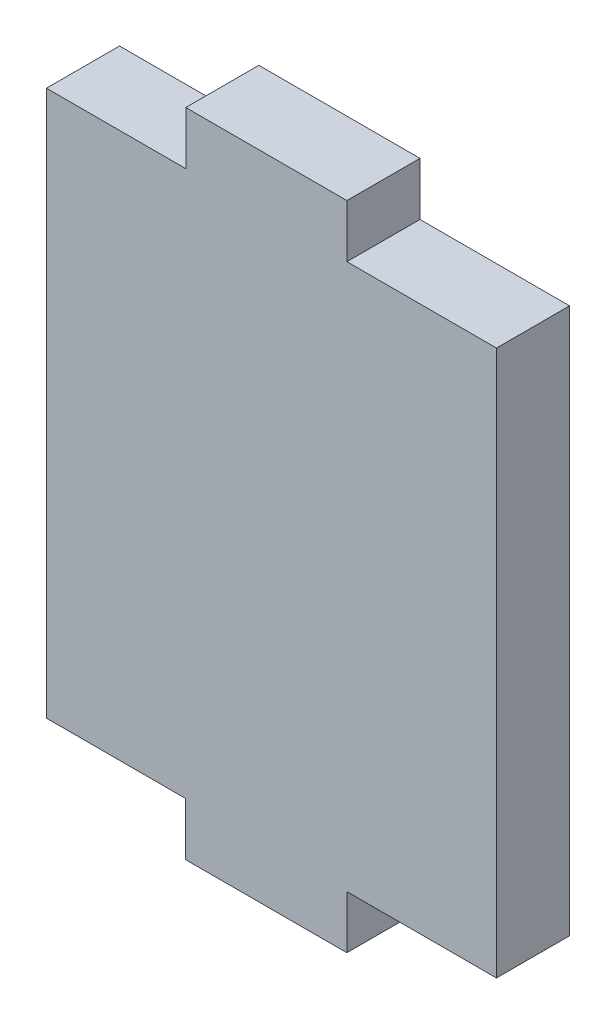
ISO-10303-21;
HEADER;
FILE_DESCRIPTION(('STEP AP214'),'2;1');
FILE_NAME('part.step','',(''),(''),'','','');
FILE_SCHEMA(('AUTOMOTIVE_DESIGN { 1 0 10303 214 1 1 1 1 }'));
ENDSEC;
DATA;
#1=APPLICATION_CONTEXT('core data for automotive mechanical design processes');
#2=APPLICATION_PROTOCOL_DEFINITION('international standard','automotive_design',2000,#1);
#3=PRODUCT_CONTEXT('',#1,'mechanical');
#4=PRODUCT('Part','Part','',(#3));
#5=PRODUCT_RELATED_PRODUCT_CATEGORY('part','',(#4));
#6=PRODUCT_DEFINITION_FORMATION('','',#4);
#7=PRODUCT_DEFINITION_CONTEXT('part definition',#1,'design');
#8=PRODUCT_DEFINITION('design','',#6,#7);
#9=PRODUCT_DEFINITION_SHAPE('','',#8);
#10=(LENGTH_UNIT() NAMED_UNIT(*) SI_UNIT(.MILLI.,.METRE.));
#11=(NAMED_UNIT(*) PLANE_ANGLE_UNIT() SI_UNIT($,.RADIAN.));
#12=(NAMED_UNIT(*) SI_UNIT($,.STERADIAN.) SOLID_ANGLE_UNIT());
#13=UNCERTAINTY_MEASURE_WITH_UNIT(LENGTH_MEASURE(1.E-05),#10,'distance_accuracy_value','');
#14=(GEOMETRIC_REPRESENTATION_CONTEXT(3) GLOBAL_UNCERTAINTY_ASSIGNED_CONTEXT((#13)) GLOBAL_UNIT_ASSIGNED_CONTEXT((#10,
#11,#12)) REPRESENTATION_CONTEXT('',''));
#15=CARTESIAN_POINT('',(0.,0.,0.));
#16=DIRECTION('',(0.,0.,1.));
#17=DIRECTION('',(1.,0.,0.));
#18=AXIS2_PLACEMENT_3D('',#15,#16,#17);
#19=CARTESIAN_POINT('',(0.,0.,3.175));
#20=DIRECTION('',(0.,1.,0.));
#21=DIRECTION('',(0.,0.,1.));
#22=AXIS2_PLACEMENT_3D('',#19,#20,#21);
#23=PLANE('',#22);
#24=DIRECTION('',(0.,0.,1.));
#25=VECTOR('',#24,1.);
#26=CARTESIAN_POINT('',(13.5,0.,0.));
#27=LINE('',#26,#25);
#28=CARTESIAN_POINT('',(13.5,0.,0.));
#29=VERTEX_POINT('',#28);
#30=CARTESIAN_POINT('',(13.5,0.,3.175));
#31=VERTEX_POINT('',#30);
#32=EDGE_CURVE('E197',#29,#31,#27,.T.);
#33=ORIENTED_EDGE('',*,*,#32,.F.);
#34=DIRECTION('',(1.,0.,0.));
#35=VECTOR('',#34,1.);
#36=CARTESIAN_POINT('',(0.,0.,0.));
#37=LINE('',#36,#35);
#38=CARTESIAN_POINT('',(20.,0.,0.));
#39=VERTEX_POINT('',#38);
#40=EDGE_CURVE('E159',#29,#39,#37,.T.);
#41=ORIENTED_EDGE('',*,*,#40,.T.);
#42=DIRECTION('',(0.,0.,-1.));
#43=VECTOR('',#42,1.);
#44=CARTESIAN_POINT('',(20.,0.,3.175));
#45=LINE('',#44,#43);
#46=CARTESIAN_POINT('',(20.,0.,3.175));
#47=VERTEX_POINT('',#46);
#48=EDGE_CURVE('E48',#47,#39,#45,.T.);
#49=ORIENTED_EDGE('',*,*,#48,.F.);
#50=DIRECTION('',(1.,0.,0.));
#51=VECTOR('',#50,1.);
#52=CARTESIAN_POINT('',(0.,0.,3.175));
#53=LINE('',#52,#51);
#54=EDGE_CURVE('E144',#31,#47,#53,.T.);
#55=ORIENTED_EDGE('',*,*,#54,.F.);
#56=EDGE_LOOP('',(#33,#41,#49,#55));
#57=FACE_BOUND('',#56,.T.);
#58=ADVANCED_FACE('F40',(#57),#23,.F.);
#59=CARTESIAN_POINT('',(0.,23.7,3.175));
#60=DIRECTION('',(0.,-1.,0.));
#61=DIRECTION('',(0.,0.,-1.));
#62=AXIS2_PLACEMENT_3D('',#59,#60,#61);
#63=PLANE('',#62);
#64=DIRECTION('',(-1.,0.,0.));
#65=VECTOR('',#64,1.);
#66=CARTESIAN_POINT('',(0.,23.7,0.));
#67=LINE('',#66,#65);
#68=CARTESIAN_POINT('',(6.502051165,23.7,0.));
#69=VERTEX_POINT('',#68);
#70=CARTESIAN_POINT('',(0.449999999999998,23.7,0.));
#71=VERTEX_POINT('',#70);
#72=EDGE_CURVE('E161',#69,#71,#67,.T.);
#73=ORIENTED_EDGE('',*,*,#72,.T.);
#74=DIRECTION('',(0.,0.,1.));
#75=VECTOR('',#74,1.);
#76=CARTESIAN_POINT('',(0.449999999999997,23.7,-6.825));
#77=LINE('',#76,#75);
#78=CARTESIAN_POINT('',(0.449999999999997,23.7,3.175));
#79=VERTEX_POINT('',#78);
#80=EDGE_CURVE('E54',#71,#79,#77,.T.);
#81=ORIENTED_EDGE('',*,*,#80,.T.);
#82=DIRECTION('',(-1.,0.,0.));
#83=VECTOR('',#82,1.);
#84=CARTESIAN_POINT('',(0.,23.7,3.175));
#85=LINE('',#84,#83);
#86=CARTESIAN_POINT('',(6.502051165,23.7,3.175));
#87=VERTEX_POINT('',#86);
#88=EDGE_CURVE('E138',#87,#79,#85,.T.);
#89=ORIENTED_EDGE('',*,*,#88,.F.);
#90=DIRECTION('',(0.,0.,1.));
#91=VECTOR('',#90,1.);
#92=CARTESIAN_POINT('',(6.502051165,23.7,0.));
#93=LINE('',#92,#91);
#94=EDGE_CURVE('E149',#69,#87,#93,.T.);
#95=ORIENTED_EDGE('',*,*,#94,.F.);
#96=EDGE_LOOP('',(#73,#81,#89,#95));
#97=FACE_BOUND('',#96,.T.);
#98=ADVANCED_FACE('F230',(#97),#63,.F.);
#99=CARTESIAN_POINT('',(0.45,0.,3.175));
#100=VERTEX_POINT('',#99);
#101=CARTESIAN_POINT('',(6.5,0.,3.175));
#102=VERTEX_POINT('',#101);
#103=EDGE_CURVE('E62',#100,#102,#53,.T.);
#104=ORIENTED_EDGE('',*,*,#103,.F.);
#105=DIRECTION('',(0.,0.,1.));
#106=VECTOR('',#105,1.);
#107=CARTESIAN_POINT('',(0.45,0.,-6.825));
#108=LINE('',#107,#106);
#109=CARTESIAN_POINT('',(0.45,0.,0.));
#110=VERTEX_POINT('',#109);
#111=EDGE_CURVE('E128',#110,#100,#108,.T.);
#112=ORIENTED_EDGE('',*,*,#111,.F.);
#113=CARTESIAN_POINT('',(6.5,0.,0.));
#114=VERTEX_POINT('',#113);
#115=EDGE_CURVE('E156',#110,#114,#37,.T.);
#116=ORIENTED_EDGE('',*,*,#115,.T.);
#117=DIRECTION('',(0.,0.,1.));
#118=VECTOR('',#117,1.);
#119=CARTESIAN_POINT('',(6.5,0.,0.));
#120=LINE('',#119,#118);
#121=EDGE_CURVE('E142',#114,#102,#120,.T.);
#122=ORIENTED_EDGE('',*,*,#121,.T.);
#123=EDGE_LOOP('',(#104,#112,#116,#122));
#124=FACE_BOUND('',#123,.T.);
#125=ADVANCED_FACE('F42',(#124),#23,.F.);
#126=CARTESIAN_POINT('',(20.,0.,3.175));
#127=DIRECTION('',(-1.,0.,0.));
#128=DIRECTION('',(0.,0.,1.));
#129=AXIS2_PLACEMENT_3D('',#126,#127,#128);
#130=PLANE('',#129);
#131=DIRECTION('',(0.,1.,0.));
#132=VECTOR('',#131,1.);
#133=CARTESIAN_POINT('',(20.,0.,0.));
#134=LINE('',#133,#132);
#135=CARTESIAN_POINT('',(20.,23.7,0.));
#136=VERTEX_POINT('',#135);
#137=EDGE_CURVE('E158',#39,#136,#134,.T.);
#138=ORIENTED_EDGE('',*,*,#137,.T.);
#139=DIRECTION('',(0.,0.,-1.));
#140=VECTOR('',#139,1.);
#141=CARTESIAN_POINT('',(20.,23.7,3.175));
#142=LINE('',#141,#140);
#143=CARTESIAN_POINT('',(20.,23.7,3.175));
#144=VERTEX_POINT('',#143);
#145=EDGE_CURVE('E155',#144,#136,#142,.T.);
#146=ORIENTED_EDGE('',*,*,#145,.F.);
#147=DIRECTION('',(0.,1.,0.));
#148=VECTOR('',#147,1.);
#149=CARTESIAN_POINT('',(20.,0.,3.175));
#150=LINE('',#149,#148);
#151=EDGE_CURVE('E143',#47,#144,#150,.T.);
#152=ORIENTED_EDGE('',*,*,#151,.F.);
#153=ORIENTED_EDGE('',*,*,#48,.T.);
#154=EDGE_LOOP('',(#138,#146,#152,#153));
#155=FACE_BOUND('',#154,.T.);
#156=ADVANCED_FACE('F170',(#155),#130,.F.);
#157=CARTESIAN_POINT('',(13.502051165,23.7,0.));
#158=VERTEX_POINT('',#157);
#159=EDGE_CURVE('E147',#136,#158,#67,.T.);
#160=ORIENTED_EDGE('',*,*,#159,.T.);
#161=DIRECTION('',(0.,0.,1.));
#162=VECTOR('',#161,1.);
#163=CARTESIAN_POINT('',(13.502051165,23.7,0.));
#164=LINE('',#163,#162);
#165=CARTESIAN_POINT('',(13.502051165,23.7,3.175));
#166=VERTEX_POINT('',#165);
#167=EDGE_CURVE('E187',#158,#166,#164,.T.);
#168=ORIENTED_EDGE('',*,*,#167,.T.);
#169=EDGE_CURVE('E152',#144,#166,#85,.T.);
#170=ORIENTED_EDGE('',*,*,#169,.F.);
#171=ORIENTED_EDGE('',*,*,#145,.T.);
#172=EDGE_LOOP('',(#160,#168,#170,#171));
#173=FACE_BOUND('',#172,.T.);
#174=ADVANCED_FACE('F185',(#173),#63,.F.);
#175=CARTESIAN_POINT('',(0.,0.,3.175));
#176=DIRECTION('',(0.,0.,-1.));
#177=DIRECTION('',(-1.,0.,0.));
#178=AXIS2_PLACEMENT_3D('',#175,#176,#177);
#179=PLANE('',#178);
#180=ORIENTED_EDGE('',*,*,#88,.T.);
#181=DIRECTION('',(0.,1.,0.));
#182=VECTOR('',#181,1.);
#183=CARTESIAN_POINT('',(0.449999999999997,23.7,3.175));
#184=LINE('',#183,#182);
#185=EDGE_CURVE('E130',#100,#79,#184,.T.);
#186=ORIENTED_EDGE('',*,*,#185,.F.);
#187=ORIENTED_EDGE('',*,*,#103,.T.);
#188=DIRECTION('',(0.,-1.,0.));
#189=VECTOR('',#188,1.);
#190=CARTESIAN_POINT('',(6.5,0.,3.175));
#191=LINE('',#190,#189);
#192=CARTESIAN_POINT('',(6.5,-2.3,3.175));
#193=VERTEX_POINT('',#192);
#194=EDGE_CURVE('E231',#102,#193,#191,.T.);
#195=ORIENTED_EDGE('',*,*,#194,.T.);
#196=DIRECTION('',(1.,0.,0.));
#197=VECTOR('',#196,1.);
#198=CARTESIAN_POINT('',(6.5,-2.3,3.175));
#199=LINE('',#198,#197);
#200=CARTESIAN_POINT('',(13.5,-2.3,3.175));
#201=VERTEX_POINT('',#200);
#202=EDGE_CURVE('E233',#193,#201,#199,.T.);
#203=ORIENTED_EDGE('',*,*,#202,.T.);
#204=DIRECTION('',(0.,1.,0.));
#205=VECTOR('',#204,1.);
#206=CARTESIAN_POINT('',(13.5,0.,3.175));
#207=LINE('',#206,#205);
#208=EDGE_CURVE('E195',#201,#31,#207,.T.);
#209=ORIENTED_EDGE('',*,*,#208,.T.);
#210=ORIENTED_EDGE('',*,*,#54,.T.);
#211=ORIENTED_EDGE('',*,*,#151,.T.);
#212=ORIENTED_EDGE('',*,*,#169,.T.);
#213=DIRECTION('',(0.,1.,0.));
#214=VECTOR('',#213,1.);
#215=CARTESIAN_POINT('',(13.502051165,23.7,3.175));
#216=LINE('',#215,#214);
#217=CARTESIAN_POINT('',(13.502051165,26.,3.175));
#218=VERTEX_POINT('',#217);
#219=EDGE_CURVE('E190',#166,#218,#216,.T.);
#220=ORIENTED_EDGE('',*,*,#219,.T.);
#221=DIRECTION('',(-1.,0.,0.));
#222=VECTOR('',#221,1.);
#223=CARTESIAN_POINT('',(6.502051165,26.,3.175));
#224=LINE('',#223,#222);
#225=CARTESIAN_POINT('',(6.502051165,26.,3.175));
#226=VERTEX_POINT('',#225);
#227=EDGE_CURVE('E211',#218,#226,#224,.T.);
#228=ORIENTED_EDGE('',*,*,#227,.T.);
#229=DIRECTION('',(0.,-1.,0.));
#230=VECTOR('',#229,1.);
#231=CARTESIAN_POINT('',(6.502051165,23.7,3.175));
#232=LINE('',#231,#230);
#233=EDGE_CURVE('E201',#226,#87,#232,.T.);
#234=ORIENTED_EDGE('',*,*,#233,.T.);
#235=EDGE_LOOP('',(#180,#186,#187,#195,#203,#209,#210,#211,#212,#220,#228,#234));
#236=FACE_BOUND('',#235,.T.);
#237=ADVANCED_FACE('F135',(#236),#179,.F.);
#238=CARTESIAN_POINT('',(0.,0.,0.));
#239=DIRECTION('',(0.,0.,-1.));
#240=DIRECTION('',(-1.,0.,0.));
#241=AXIS2_PLACEMENT_3D('',#238,#239,#240);
#242=PLANE('',#241);
#243=DIRECTION('',(0.,-1.,0.));
#244=VECTOR('',#243,1.);
#245=CARTESIAN_POINT('',(0.45,0.,0.));
#246=LINE('',#245,#244);
#247=EDGE_CURVE('E11',#71,#110,#246,.T.);
#248=ORIENTED_EDGE('',*,*,#247,.F.);
#249=ORIENTED_EDGE('',*,*,#72,.F.);
#250=DIRECTION('',(0.,-1.,0.));
#251=VECTOR('',#250,1.);
#252=CARTESIAN_POINT('',(6.502051165,23.7,0.));
#253=LINE('',#252,#251);
#254=CARTESIAN_POINT('',(6.502051165,26.,0.));
#255=VERTEX_POINT('',#254);
#256=EDGE_CURVE('E209',#255,#69,#253,.T.);
#257=ORIENTED_EDGE('',*,*,#256,.F.);
#258=DIRECTION('',(-1.,0.,0.));
#259=VECTOR('',#258,1.);
#260=CARTESIAN_POINT('',(6.502051165,26.,0.));
#261=LINE('',#260,#259);
#262=CARTESIAN_POINT('',(13.502051165,26.,0.));
#263=VERTEX_POINT('',#262);
#264=EDGE_CURVE('E213',#263,#255,#261,.T.);
#265=ORIENTED_EDGE('',*,*,#264,.F.);
#266=DIRECTION('',(0.,1.,0.));
#267=VECTOR('',#266,1.);
#268=CARTESIAN_POINT('',(13.502051165,23.7,0.));
#269=LINE('',#268,#267);
#270=EDGE_CURVE('E182',#158,#263,#269,.T.);
#271=ORIENTED_EDGE('',*,*,#270,.F.);
#272=ORIENTED_EDGE('',*,*,#159,.F.);
#273=ORIENTED_EDGE('',*,*,#137,.F.);
#274=ORIENTED_EDGE('',*,*,#40,.F.);
#275=DIRECTION('',(0.,1.,0.));
#276=VECTOR('',#275,1.);
#277=CARTESIAN_POINT('',(13.5,0.,0.));
#278=LINE('',#277,#276);
#279=CARTESIAN_POINT('',(13.5,-2.3,0.));
#280=VERTEX_POINT('',#279);
#281=EDGE_CURVE('E208',#280,#29,#278,.T.);
#282=ORIENTED_EDGE('',*,*,#281,.F.);
#283=DIRECTION('',(1.,0.,0.));
#284=VECTOR('',#283,1.);
#285=CARTESIAN_POINT('',(6.5,-2.3,0.));
#286=LINE('',#285,#284);
#287=CARTESIAN_POINT('',(6.5,-2.3,0.));
#288=VERTEX_POINT('',#287);
#289=EDGE_CURVE('E239',#288,#280,#286,.T.);
#290=ORIENTED_EDGE('',*,*,#289,.F.);
#291=DIRECTION('',(0.,-1.,0.));
#292=VECTOR('',#291,1.);
#293=CARTESIAN_POINT('',(6.5,0.,0.));
#294=LINE('',#293,#292);
#295=EDGE_CURVE('E236',#114,#288,#294,.T.);
#296=ORIENTED_EDGE('',*,*,#295,.F.);
#297=ORIENTED_EDGE('',*,*,#115,.F.);
#298=EDGE_LOOP('',(#248,#249,#257,#265,#271,#272,#273,#274,#282,#290,#296,#297));
#299=FACE_BOUND('',#298,.T.);
#300=ADVANCED_FACE('F177',(#299),#242,.T.);
#301=CARTESIAN_POINT('',(6.502051165,23.7,0.));
#302=DIRECTION('',(-1.,0.,0.));
#303=DIRECTION('',(0.,-1.,0.));
#304=AXIS2_PLACEMENT_3D('',#301,#302,#303);
#305=PLANE('',#304);
#306=ORIENTED_EDGE('',*,*,#233,.F.);
#307=DIRECTION('',(0.,0.,1.));
#308=VECTOR('',#307,1.);
#309=CARTESIAN_POINT('',(6.502051165,26.,0.));
#310=LINE('',#309,#308);
#311=EDGE_CURVE('E219',#255,#226,#310,.T.);
#312=ORIENTED_EDGE('',*,*,#311,.F.);
#313=ORIENTED_EDGE('',*,*,#256,.T.);
#314=ORIENTED_EDGE('',*,*,#94,.T.);
#315=EDGE_LOOP('',(#306,#312,#313,#314));
#316=FACE_BOUND('',#315,.T.);
#317=ADVANCED_FACE('F225',(#316),#305,.T.);
#318=CARTESIAN_POINT('',(6.502051165,26.,0.));
#319=DIRECTION('',(0.,1.,0.));
#320=DIRECTION('',(0.,0.,1.));
#321=AXIS2_PLACEMENT_3D('',#318,#319,#320);
#322=PLANE('',#321);
#323=ORIENTED_EDGE('',*,*,#227,.F.);
#324=DIRECTION('',(0.,0.,1.));
#325=VECTOR('',#324,1.);
#326=CARTESIAN_POINT('',(13.502051165,26.,0.));
#327=LINE('',#326,#325);
#328=EDGE_CURVE('E221',#263,#218,#327,.T.);
#329=ORIENTED_EDGE('',*,*,#328,.F.);
#330=ORIENTED_EDGE('',*,*,#264,.T.);
#331=ORIENTED_EDGE('',*,*,#311,.T.);
#332=EDGE_LOOP('',(#323,#329,#330,#331));
#333=FACE_BOUND('',#332,.T.);
#334=ADVANCED_FACE('F279',(#333),#322,.T.);
#335=CARTESIAN_POINT('',(13.502051165,23.7,0.));
#336=DIRECTION('',(1.,0.,0.));
#337=DIRECTION('',(0.,0.,-1.));
#338=AXIS2_PLACEMENT_3D('',#335,#336,#337);
#339=PLANE('',#338);
#340=ORIENTED_EDGE('',*,*,#219,.F.);
#341=ORIENTED_EDGE('',*,*,#167,.F.);
#342=ORIENTED_EDGE('',*,*,#270,.T.);
#343=ORIENTED_EDGE('',*,*,#328,.T.);
#344=EDGE_LOOP('',(#340,#341,#342,#343));
#345=FACE_BOUND('',#344,.T.);
#346=ADVANCED_FACE('F256',(#345),#339,.T.);
#347=CARTESIAN_POINT('',(6.5,0.,0.));
#348=DIRECTION('',(-1.,0.,0.));
#349=DIRECTION('',(0.,0.,1.));
#350=AXIS2_PLACEMENT_3D('',#347,#348,#349);
#351=PLANE('',#350);
#352=ORIENTED_EDGE('',*,*,#194,.F.);
#353=ORIENTED_EDGE('',*,*,#121,.F.);
#354=ORIENTED_EDGE('',*,*,#295,.T.);
#355=DIRECTION('',(0.,0.,1.));
#356=VECTOR('',#355,1.);
#357=CARTESIAN_POINT('',(6.5,-2.3,0.));
#358=LINE('',#357,#356);
#359=EDGE_CURVE('E203',#288,#193,#358,.T.);
#360=ORIENTED_EDGE('',*,*,#359,.T.);
#361=EDGE_LOOP('',(#352,#353,#354,#360));
#362=FACE_BOUND('',#361,.T.);
#363=ADVANCED_FACE('F249',(#362),#351,.T.);
#364=CARTESIAN_POINT('',(13.5,0.,0.));
#365=DIRECTION('',(1.,0.,0.));
#366=DIRECTION('',(0.,0.,-1.));
#367=AXIS2_PLACEMENT_3D('',#364,#365,#366);
#368=PLANE('',#367);
#369=ORIENTED_EDGE('',*,*,#208,.F.);
#370=DIRECTION('',(0.,0.,1.));
#371=VECTOR('',#370,1.);
#372=CARTESIAN_POINT('',(13.5,-2.3,0.));
#373=LINE('',#372,#371);
#374=EDGE_CURVE('E199',#280,#201,#373,.T.);
#375=ORIENTED_EDGE('',*,*,#374,.F.);
#376=ORIENTED_EDGE('',*,*,#281,.T.);
#377=ORIENTED_EDGE('',*,*,#32,.T.);
#378=EDGE_LOOP('',(#369,#375,#376,#377));
#379=FACE_BOUND('',#378,.T.);
#380=ADVANCED_FACE('F247',(#379),#368,.T.);
#381=CARTESIAN_POINT('',(6.5,-2.3,0.));
#382=DIRECTION('',(0.,-1.,0.));
#383=DIRECTION('',(0.,0.,-1.));
#384=AXIS2_PLACEMENT_3D('',#381,#382,#383);
#385=PLANE('',#384);
#386=ORIENTED_EDGE('',*,*,#202,.F.);
#387=ORIENTED_EDGE('',*,*,#359,.F.);
#388=ORIENTED_EDGE('',*,*,#289,.T.);
#389=ORIENTED_EDGE('',*,*,#374,.T.);
#390=EDGE_LOOP('',(#386,#387,#388,#389));
#391=FACE_BOUND('',#390,.T.);
#392=ADVANCED_FACE('F245',(#391),#385,.T.);
#393=CARTESIAN_POINT('',(0.449999999999997,23.7,-6.825));
#394=DIRECTION('',(1.,0.,0.));
#395=DIRECTION('',(0.,1.,0.));
#396=AXIS2_PLACEMENT_3D('',#393,#394,#395);
#397=PLANE('',#396);
#398=ORIENTED_EDGE('',*,*,#247,.T.);
#399=ORIENTED_EDGE('',*,*,#111,.T.);
#400=ORIENTED_EDGE('',*,*,#185,.T.);
#401=ORIENTED_EDGE('',*,*,#80,.F.);
#402=EDGE_LOOP('',(#398,#399,#400,#401));
#403=FACE_BOUND('',#402,.T.);
#404=ADVANCED_FACE('F129',(#403),#397,.F.);
#405=CLOSED_SHELL('',(#58,#98,#125,#156,#174,#237,#300,#317,#334,#346,#363,#380,#392,#404));
#406=MANIFOLD_SOLID_BREP('B2',#405);
#407=ADVANCED_BREP_SHAPE_REPRESENTATION('',(#18,#406),#14);
#408=SHAPE_DEFINITION_REPRESENTATION(#9,#407);
ENDSEC;
END-ISO-10303-21;
